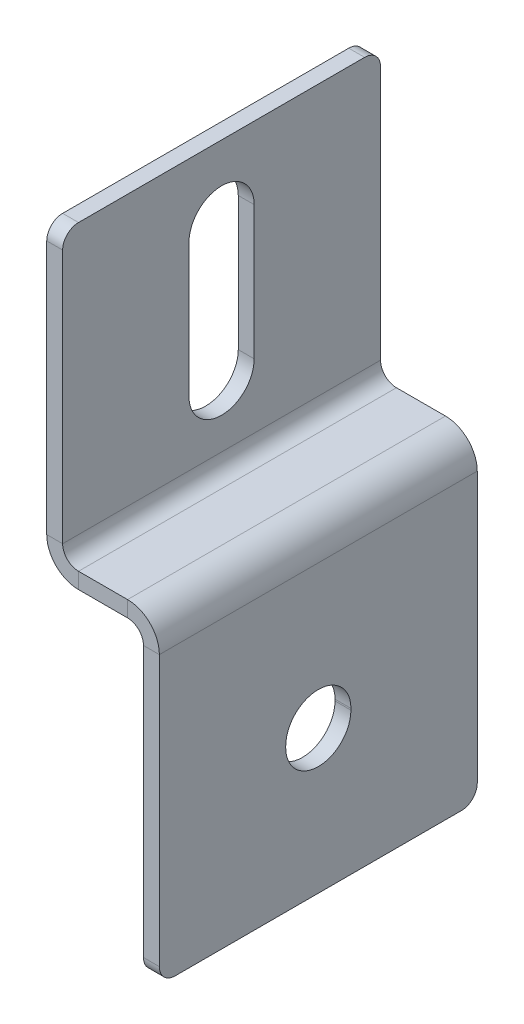
ISO-10303-21;
HEADER;
FILE_DESCRIPTION(('STEP AP214'),'2;1');
FILE_NAME('part.step','',(''),(''),'','','');
FILE_SCHEMA(('AUTOMOTIVE_DESIGN { 1 0 10303 214 1 1 1 1 }'));
ENDSEC;
DATA;
#1=APPLICATION_CONTEXT('core data for automotive mechanical design processes');
#2=APPLICATION_PROTOCOL_DEFINITION('international standard','automotive_design',2000,#1);
#3=PRODUCT_CONTEXT('',#1,'mechanical');
#4=PRODUCT('Part','Part','',(#3));
#5=PRODUCT_RELATED_PRODUCT_CATEGORY('part','',(#4));
#6=PRODUCT_DEFINITION_FORMATION('','',#4);
#7=PRODUCT_DEFINITION_CONTEXT('part definition',#1,'design');
#8=PRODUCT_DEFINITION('design','',#6,#7);
#9=PRODUCT_DEFINITION_SHAPE('','',#8);
#10=(LENGTH_UNIT() NAMED_UNIT(*) SI_UNIT(.MILLI.,.METRE.));
#11=(NAMED_UNIT(*) PLANE_ANGLE_UNIT() SI_UNIT($,.RADIAN.));
#12=(NAMED_UNIT(*) SI_UNIT($,.STERADIAN.) SOLID_ANGLE_UNIT());
#13=UNCERTAINTY_MEASURE_WITH_UNIT(LENGTH_MEASURE(1.E-05),#10,'distance_accuracy_value','');
#14=(GEOMETRIC_REPRESENTATION_CONTEXT(3) GLOBAL_UNCERTAINTY_ASSIGNED_CONTEXT((#13)) GLOBAL_UNIT_ASSIGNED_CONTEXT((#10,
#11,#12)) REPRESENTATION_CONTEXT('',''));
#15=CARTESIAN_POINT('',(0.,0.,0.));
#16=DIRECTION('',(0.,0.,1.));
#17=DIRECTION('',(1.,0.,0.));
#18=AXIS2_PLACEMENT_3D('',#15,#16,#17);
#19=CARTESIAN_POINT('',(5.72382950558037,-18.8016265865805,4.16300808576047));
#20=DIRECTION('',(0.,0.,-1.));
#21=DIRECTION('',(0.,-1.,0.));
#22=AXIS2_PLACEMENT_3D('',#19,#20,#21);
#23=PLANE('',#22);
#24=DIRECTION('',(1.,0.,0.));
#25=VECTOR('',#24,1.);
#26=CARTESIAN_POINT('',(5.72382950558037,-18.8016265865805,4.16300808576047));
#27=LINE('',#26,#25);
#28=CARTESIAN_POINT('',(3.72382950558036,-18.8016265865805,4.16300808576047));
#29=VERTEX_POINT('',#28);
#30=CARTESIAN_POINT('',(5.72382950558037,-18.8016265865805,4.16300808576047));
#31=VERTEX_POINT('',#30);
#32=EDGE_CURVE('E205',#29,#31,#27,.T.);
#33=ORIENTED_EDGE('',*,*,#32,.F.);
#34=DIRECTION('',(0.,-1.,0.));
#35=VECTOR('',#34,1.);
#36=CARTESIAN_POINT('',(3.72382950558035,3.29837341341954,4.16300808576047));
#37=LINE('',#36,#35);
#38=CARTESIAN_POINT('',(3.72382950558036,-18.6016265865805,4.16300808576047));
#39=VERTEX_POINT('',#38);
#40=EDGE_CURVE('E325',#39,#29,#37,.T.);
#41=ORIENTED_EDGE('',*,*,#40,.F.);
#42=DIRECTION('',(1.,0.,0.));
#43=VECTOR('',#42,1.);
#44=CARTESIAN_POINT('',(5.72382950558037,-18.6016265865805,4.16300808576047));
#45=LINE('',#44,#43);
#46=CARTESIAN_POINT('',(5.72382950558037,-18.6016265865805,4.16300808576047));
#47=VERTEX_POINT('',#46);
#48=EDGE_CURVE('E354',#39,#47,#45,.T.);
#49=ORIENTED_EDGE('',*,*,#48,.T.);
#50=DIRECTION('',(0.,-1.,0.));
#51=VECTOR('',#50,1.);
#52=CARTESIAN_POINT('',(5.72382950558037,-18.8016265865805,4.16300808576047));
#53=LINE('',#52,#51);
#54=EDGE_CURVE('E206',#47,#31,#53,.T.);
#55=ORIENTED_EDGE('',*,*,#54,.T.);
#56=EDGE_LOOP('',(#33,#41,#49,#55));
#57=FACE_BOUND('',#56,.T.);
#58=ADVANCED_FACE('F16',(#57),#23,.T.);
#59=CARTESIAN_POINT('',(5.72382950558037,-18.6016265865805,0.0630080857604264));
#60=DIRECTION('',(-1.,0.,0.));
#61=DIRECTION('',(0.,-1.,0.));
#62=AXIS2_PLACEMENT_3D('',#59,#60,#61);
#63=CYLINDRICAL_SURFACE('',#62,4.10000000000004);
#64=ORIENTED_EDGE('',*,*,#48,.F.);
#65=CARTESIAN_POINT('',(3.72382950558037,-18.6016265865805,0.0630080857604264));
#66=DIRECTION('',(1.,0.,0.));
#67=DIRECTION('',(0.,1.,0.));
#68=AXIS2_PLACEMENT_3D('',#65,#66,#67);
#69=CIRCLE('',#68,4.10000000000004);
#70=CARTESIAN_POINT('',(3.72382950558036,-18.6016265865805,-4.03699191423961));
#71=VERTEX_POINT('',#70);
#72=EDGE_CURVE('E311',#71,#39,#69,.T.);
#73=ORIENTED_EDGE('',*,*,#72,.F.);
#74=DIRECTION('',(1.,0.,0.));
#75=VECTOR('',#74,1.);
#76=CARTESIAN_POINT('',(5.72382950558037,-18.6016265865805,-4.03699191423961));
#77=LINE('',#76,#75);
#78=CARTESIAN_POINT('',(5.72382950558037,-18.6016265865805,-4.03699191423961));
#79=VERTEX_POINT('',#78);
#80=EDGE_CURVE('E190',#71,#79,#77,.T.);
#81=ORIENTED_EDGE('',*,*,#80,.T.);
#82=CARTESIAN_POINT('',(5.72382950558037,-18.6016265865805,0.0630080857604264));
#83=DIRECTION('',(1.,0.,0.));
#84=DIRECTION('',(0.,1.,0.));
#85=AXIS2_PLACEMENT_3D('',#82,#83,#84);
#86=CIRCLE('',#85,4.10000000000004);
#87=EDGE_CURVE('E201',#79,#47,#86,.T.);
#88=ORIENTED_EDGE('',*,*,#87,.T.);
#89=EDGE_LOOP('',(#64,#73,#81,#88));
#90=FACE_BOUND('',#89,.T.);
#91=ADVANCED_FACE('F489',(#90),#63,.F.);
#92=CARTESIAN_POINT('',(5.72382950558037,-18.8016265865805,-4.03699191423961));
#93=DIRECTION('',(0.,0.,1.));
#94=DIRECTION('',(0.,1.,0.));
#95=AXIS2_PLACEMENT_3D('',#92,#93,#94);
#96=PLANE('',#95);
#97=ORIENTED_EDGE('',*,*,#80,.F.);
#98=DIRECTION('',(0.,-1.,0.));
#99=VECTOR('',#98,1.);
#100=CARTESIAN_POINT('',(3.72382950558035,3.29837341341954,-4.03699191423961));
#101=LINE('',#100,#99);
#102=CARTESIAN_POINT('',(3.72382950558036,-18.8016265865805,-4.03699191423961));
#103=VERTEX_POINT('',#102);
#104=EDGE_CURVE('E185',#103,#71,#101,.F.);
#105=ORIENTED_EDGE('',*,*,#104,.F.);
#106=DIRECTION('',(1.,0.,0.));
#107=VECTOR('',#106,1.);
#108=CARTESIAN_POINT('',(5.72382950558036,-18.8016265865805,-4.03699191423961));
#109=LINE('',#108,#107);
#110=CARTESIAN_POINT('',(5.72382950558036,-18.8016265865805,-4.03699191423961));
#111=VERTEX_POINT('',#110);
#112=EDGE_CURVE('E179',#103,#111,#109,.T.);
#113=ORIENTED_EDGE('',*,*,#112,.T.);
#114=DIRECTION('',(0.,1.,0.));
#115=VECTOR('',#114,1.);
#116=CARTESIAN_POINT('',(5.72382950558037,-18.8016265865805,-4.03699191423961));
#117=LINE('',#116,#115);
#118=EDGE_CURVE('E182',#111,#79,#117,.T.);
#119=ORIENTED_EDGE('',*,*,#118,.T.);
#120=EDGE_LOOP('',(#97,#105,#113,#119));
#121=FACE_BOUND('',#120,.T.);
#122=ADVANCED_FACE('F181',(#121),#96,.T.);
#123=CARTESIAN_POINT('',(-6.44617049441965,3.29837341341954,20.0630080857604));
#124=DIRECTION('',(0.,0.,1.));
#125=DIRECTION('',(-1.,0.,0.));
#126=AXIS2_PLACEMENT_3D('',#123,#124,#125);
#127=PLANE('',#126);
#128=DIRECTION('',(0.,1.,0.));
#129=VECTOR('',#128,1.);
#130=CARTESIAN_POINT('',(-4.44617049441965,3.29837341341954,20.0630080857604));
#131=LINE('',#130,#129);
#132=CARTESIAN_POINT('',(-4.44617049441965,1.29837341341954,20.0630080857604));
#133=VERTEX_POINT('',#132);
#134=CARTESIAN_POINT('',(-4.44617049441965,3.29837341341954,20.0630080857604));
#135=VERTEX_POINT('',#134);
#136=EDGE_CURVE('E191',#133,#135,#131,.T.);
#137=ORIENTED_EDGE('',*,*,#136,.F.);
#138=DIRECTION('',(1.,0.,0.));
#139=VECTOR('',#138,1.);
#140=CARTESIAN_POINT('',(-6.44617049441965,1.29837341341954,20.0630080857604));
#141=LINE('',#140,#139);
#142=CARTESIAN_POINT('',(1.72382950558035,1.29837341341954,20.0630080857604));
#143=VERTEX_POINT('',#142);
#144=EDGE_CURVE('E303',#143,#133,#141,.F.);
#145=ORIENTED_EDGE('',*,*,#144,.F.);
#146=DIRECTION('',(0.,1.,0.));
#147=VECTOR('',#146,1.);
#148=CARTESIAN_POINT('',(1.72382950558035,3.29837341341954,20.0630080857604));
#149=LINE('',#148,#147);
#150=CARTESIAN_POINT('',(1.72382950558035,3.29837341341954,20.0630080857604));
#151=VERTEX_POINT('',#150);
#152=EDGE_CURVE('E349',#143,#151,#149,.T.);
#153=ORIENTED_EDGE('',*,*,#152,.T.);
#154=DIRECTION('',(-1.,0.,0.));
#155=VECTOR('',#154,1.);
#156=CARTESIAN_POINT('',(-6.44617049441965,3.29837341341954,20.0630080857604));
#157=LINE('',#156,#155);
#158=EDGE_CURVE('E202',#151,#135,#157,.T.);
#159=ORIENTED_EDGE('',*,*,#158,.T.);
#160=EDGE_LOOP('',(#137,#145,#153,#159));
#161=FACE_BOUND('',#160,.T.);
#162=ADVANCED_FACE('F417',(#161),#127,.T.);
#163=CARTESIAN_POINT('',(1.72382950558035,-0.701626586580458,20.0630080857604));
#164=DIRECTION('',(0.,0.,-1.));
#165=DIRECTION('',(-1.,0.,0.));
#166=AXIS2_PLACEMENT_3D('',#163,#164,#165);
#167=PLANE('',#166);
#168=ORIENTED_EDGE('',*,*,#152,.F.);
#169=CARTESIAN_POINT('',(1.72382950558035,-0.701626586580458,20.0630080857604));
#170=DIRECTION('',(0.,0.,-1.));
#171=DIRECTION('',(-1.,0.,0.));
#172=AXIS2_PLACEMENT_3D('',#169,#170,#171);
#173=CIRCLE('',#172,2.);
#174=CARTESIAN_POINT('',(3.72382950558035,-0.701626586580458,20.0630080857604));
#175=VERTEX_POINT('',#174);
#176=EDGE_CURVE('E304',#143,#175,#173,.T.);
#177=ORIENTED_EDGE('',*,*,#176,.T.);
#178=DIRECTION('',(1.,0.,0.));
#179=VECTOR('',#178,1.);
#180=CARTESIAN_POINT('',(5.72382950558035,-0.701626586580457,20.0630080857604));
#181=LINE('',#180,#179);
#182=CARTESIAN_POINT('',(5.72382950558035,-0.701626586580457,20.0630080857604));
#183=VERTEX_POINT('',#182);
#184=EDGE_CURVE('E346',#175,#183,#181,.T.);
#185=ORIENTED_EDGE('',*,*,#184,.T.);
#186=CARTESIAN_POINT('',(1.72382950558035,-0.701626586580458,20.0630080857604));
#187=DIRECTION('',(0.,0.,1.));
#188=DIRECTION('',(1.,0.,0.));
#189=AXIS2_PLACEMENT_3D('',#186,#187,#188);
#190=CIRCLE('',#189,4.);
#191=EDGE_CURVE('E248',#151,#183,#190,.F.);
#192=ORIENTED_EDGE('',*,*,#191,.F.);
#193=EDGE_LOOP('',(#168,#177,#185,#192));
#194=FACE_BOUND('',#193,.T.);
#195=ADVANCED_FACE('F450',(#194),#167,.F.);
#196=CARTESIAN_POINT('',(5.72382950558035,3.29837341341954,20.0630080857604));
#197=DIRECTION('',(0.,0.,1.));
#198=DIRECTION('',(0.,1.,0.));
#199=AXIS2_PLACEMENT_3D('',#196,#197,#198);
#200=PLANE('',#199);
#201=DIRECTION('',(0.,-1.,0.));
#202=VECTOR('',#201,1.);
#203=CARTESIAN_POINT('',(3.72382950558035,3.29837341341954,20.0630080857604));
#204=LINE('',#203,#202);
#205=CARTESIAN_POINT('',(3.72382950558036,-34.7016265865805,20.0630080857604));
#206=VERTEX_POINT('',#205);
#207=EDGE_CURVE('E310',#206,#175,#204,.F.);
#208=ORIENTED_EDGE('',*,*,#207,.F.);
#209=DIRECTION('',(-1.,0.,0.));
#210=VECTOR('',#209,1.);
#211=CARTESIAN_POINT('',(5.72382950558036,-34.7016265865805,20.0630080857604));
#212=LINE('',#211,#210);
#213=CARTESIAN_POINT('',(5.72382950558036,-34.7016265865805,20.0630080857604));
#214=VERTEX_POINT('',#213);
#215=EDGE_CURVE('E372',#206,#214,#212,.F.);
#216=ORIENTED_EDGE('',*,*,#215,.T.);
#217=DIRECTION('',(0.,1.,0.));
#218=VECTOR('',#217,1.);
#219=CARTESIAN_POINT('',(5.72382950558035,3.29837341341954,20.0630080857604));
#220=LINE('',#219,#218);
#221=EDGE_CURVE('E214',#214,#183,#220,.T.);
#222=ORIENTED_EDGE('',*,*,#221,.T.);
#223=ORIENTED_EDGE('',*,*,#184,.F.);
#224=EDGE_LOOP('',(#208,#216,#222,#223));
#225=FACE_BOUND('',#224,.T.);
#226=ADVANCED_FACE('F478',(#225),#200,.T.);
#227=CARTESIAN_POINT('',(5.72382950558036,-36.7016265865805,20.0630080857604));
#228=DIRECTION('',(0.,1.,0.));
#229=DIRECTION('',(0.,0.,-1.));
#230=AXIS2_PLACEMENT_3D('',#227,#228,#229);
#231=PLANE('',#230);
#232=DIRECTION('',(0.,0.,1.));
#233=VECTOR('',#232,1.);
#234=CARTESIAN_POINT('',(3.72382950558036,-36.7016265865805,20.0630080857604));
#235=LINE('',#234,#233);
#236=CARTESIAN_POINT('',(3.72382950558036,-36.7016265865805,18.0630080857604));
#237=VERTEX_POINT('',#236);
#238=CARTESIAN_POINT('',(3.72382950558036,-36.7016265865805,-17.9369919142396));
#239=VERTEX_POINT('',#238);
#240=EDGE_CURVE('E281',#237,#239,#235,.F.);
#241=ORIENTED_EDGE('',*,*,#240,.T.);
#242=DIRECTION('',(-1.,0.,0.));
#243=VECTOR('',#242,1.);
#244=CARTESIAN_POINT('',(5.72382950558036,-36.7016265865805,-17.9369919142396));
#245=LINE('',#244,#243);
#246=CARTESIAN_POINT('',(5.72382950558036,-36.7016265865805,-17.9369919142396));
#247=VERTEX_POINT('',#246);
#248=EDGE_CURVE('E359',#239,#247,#245,.F.);
#249=ORIENTED_EDGE('',*,*,#248,.T.);
#250=DIRECTION('',(0.,0.,-1.));
#251=VECTOR('',#250,1.);
#252=CARTESIAN_POINT('',(5.72382950558036,-36.7016265865805,20.0630080857604));
#253=LINE('',#252,#251);
#254=CARTESIAN_POINT('',(5.72382950558036,-36.7016265865805,18.0630080857604));
#255=VERTEX_POINT('',#254);
#256=EDGE_CURVE('E216',#255,#247,#253,.T.);
#257=ORIENTED_EDGE('',*,*,#256,.F.);
#258=DIRECTION('',(1.,0.,0.));
#259=VECTOR('',#258,1.);
#260=CARTESIAN_POINT('',(5.72382950558036,-36.7016265865805,18.0630080857604));
#261=LINE('',#260,#259);
#262=EDGE_CURVE('E356',#255,#237,#261,.F.);
#263=ORIENTED_EDGE('',*,*,#262,.T.);
#264=EDGE_LOOP('',(#241,#249,#257,#263));
#265=FACE_BOUND('',#264,.T.);
#266=ADVANCED_FACE('F470',(#265),#231,.F.);
#267=CARTESIAN_POINT('',(5.72382950558035,3.29837341341954,-19.9369919142396));
#268=DIRECTION('',(0.,0.,1.));
#269=DIRECTION('',(0.,1.,0.));
#270=AXIS2_PLACEMENT_3D('',#267,#268,#269);
#271=PLANE('',#270);
#272=DIRECTION('',(0.,1.,0.));
#273=VECTOR('',#272,1.);
#274=CARTESIAN_POINT('',(5.72382950558035,3.29837341341954,-19.9369919142396));
#275=LINE('',#274,#273);
#276=CARTESIAN_POINT('',(5.72382950558036,-34.7016265865805,-19.9369919142396));
#277=VERTEX_POINT('',#276);
#278=CARTESIAN_POINT('',(5.72382950558035,-0.701626586580457,-19.9369919142396));
#279=VERTEX_POINT('',#278);
#280=EDGE_CURVE('E212',#277,#279,#275,.T.);
#281=ORIENTED_EDGE('',*,*,#280,.F.);
#282=DIRECTION('',(-1.,0.,0.));
#283=VECTOR('',#282,1.);
#284=CARTESIAN_POINT('',(5.72382950558036,-34.7016265865805,-19.9369919142396));
#285=LINE('',#284,#283);
#286=CARTESIAN_POINT('',(3.72382950558036,-34.7016265865805,-19.9369919142396));
#287=VERTEX_POINT('',#286);
#288=EDGE_CURVE('E366',#277,#287,#285,.T.);
#289=ORIENTED_EDGE('',*,*,#288,.T.);
#290=DIRECTION('',(0.,-1.,0.));
#291=VECTOR('',#290,1.);
#292=CARTESIAN_POINT('',(3.72382950558035,3.29837341341954,-19.9369919142396));
#293=LINE('',#292,#291);
#294=CARTESIAN_POINT('',(3.72382950558035,-0.701626586580457,-19.9369919142396));
#295=VERTEX_POINT('',#294);
#296=EDGE_CURVE('E308',#287,#295,#293,.F.);
#297=ORIENTED_EDGE('',*,*,#296,.T.);
#298=DIRECTION('',(1.,0.,0.));
#299=VECTOR('',#298,1.);
#300=CARTESIAN_POINT('',(5.72382950558035,-0.701626586580457,-19.9369919142396));
#301=LINE('',#300,#299);
#302=EDGE_CURVE('E343',#295,#279,#301,.T.);
#303=ORIENTED_EDGE('',*,*,#302,.T.);
#304=EDGE_LOOP('',(#281,#289,#297,#303));
#305=FACE_BOUND('',#304,.T.);
#306=ADVANCED_FACE('F459',(#305),#271,.F.);
#307=CARTESIAN_POINT('',(1.72382950558035,-0.701626586580458,-19.9369919142396));
#308=DIRECTION('',(0.,0.,1.));
#309=DIRECTION('',(1.,0.,0.));
#310=AXIS2_PLACEMENT_3D('',#307,#308,#309);
#311=PLANE('',#310);
#312=ORIENTED_EDGE('',*,*,#302,.F.);
#313=CARTESIAN_POINT('',(1.72382950558035,-0.701626586580458,-19.9369919142396));
#314=DIRECTION('',(0.,0.,-1.));
#315=DIRECTION('',(-1.,0.,0.));
#316=AXIS2_PLACEMENT_3D('',#313,#314,#315);
#317=CIRCLE('',#316,2.);
#318=CARTESIAN_POINT('',(1.72382950558035,1.29837341341954,-19.9369919142396));
#319=VERTEX_POINT('',#318);
#320=EDGE_CURVE('E305',#295,#319,#317,.F.);
#321=ORIENTED_EDGE('',*,*,#320,.T.);
#322=DIRECTION('',(0.,1.,0.));
#323=VECTOR('',#322,1.);
#324=CARTESIAN_POINT('',(1.72382950558035,3.29837341341954,-19.9369919142396));
#325=LINE('',#324,#323);
#326=CARTESIAN_POINT('',(1.72382950558035,3.29837341341954,-19.9369919142396));
#327=VERTEX_POINT('',#326);
#328=EDGE_CURVE('E341',#319,#327,#325,.T.);
#329=ORIENTED_EDGE('',*,*,#328,.T.);
#330=CARTESIAN_POINT('',(1.72382950558035,-0.701626586580458,-19.9369919142396));
#331=DIRECTION('',(0.,0.,-1.));
#332=DIRECTION('',(-1.,0.,0.));
#333=AXIS2_PLACEMENT_3D('',#330,#331,#332);
#334=CIRCLE('',#333,4.);
#335=EDGE_CURVE('E245',#279,#327,#334,.F.);
#336=ORIENTED_EDGE('',*,*,#335,.F.);
#337=EDGE_LOOP('',(#312,#321,#329,#336));
#338=FACE_BOUND('',#337,.T.);
#339=ADVANCED_FACE('F444',(#338),#311,.F.);
#340=CARTESIAN_POINT('',(-6.44617049441965,3.29837341341954,-19.9369919142396));
#341=DIRECTION('',(0.,0.,1.));
#342=DIRECTION('',(-1.,0.,0.));
#343=AXIS2_PLACEMENT_3D('',#340,#341,#342);
#344=PLANE('',#343);
#345=ORIENTED_EDGE('',*,*,#328,.F.);
#346=DIRECTION('',(1.,0.,0.));
#347=VECTOR('',#346,1.);
#348=CARTESIAN_POINT('',(-6.44617049441965,1.29837341341954,-19.9369919142396));
#349=LINE('',#348,#347);
#350=CARTESIAN_POINT('',(-4.44617049441965,1.29837341341954,-19.9369919142396));
#351=VERTEX_POINT('',#350);
#352=EDGE_CURVE('E300',#319,#351,#349,.F.);
#353=ORIENTED_EDGE('',*,*,#352,.T.);
#354=DIRECTION('',(0.,1.,0.));
#355=VECTOR('',#354,1.);
#356=CARTESIAN_POINT('',(-4.44617049441965,3.29837341341954,-19.9369919142396));
#357=LINE('',#356,#355);
#358=CARTESIAN_POINT('',(-4.44617049441965,3.29837341341954,-19.9369919142396));
#359=VERTEX_POINT('',#358);
#360=EDGE_CURVE('E339',#351,#359,#357,.T.);
#361=ORIENTED_EDGE('',*,*,#360,.T.);
#362=DIRECTION('',(-1.,0.,0.));
#363=VECTOR('',#362,1.);
#364=CARTESIAN_POINT('',(-6.44617049441965,3.29837341341954,-19.9369919142396));
#365=LINE('',#364,#363);
#366=EDGE_CURVE('E252',#327,#359,#365,.T.);
#367=ORIENTED_EDGE('',*,*,#366,.F.);
#368=EDGE_LOOP('',(#345,#353,#361,#367));
#369=FACE_BOUND('',#368,.T.);
#370=ADVANCED_FACE('F436',(#369),#344,.F.);
#371=CARTESIAN_POINT('',(-4.44617049441965,5.29837341341954,-19.9369919142396));
#372=DIRECTION('',(0.,0.,-1.));
#373=DIRECTION('',(-1.,0.,0.));
#374=AXIS2_PLACEMENT_3D('',#371,#372,#373);
#375=PLANE('',#374);
#376=ORIENTED_EDGE('',*,*,#360,.F.);
#377=CARTESIAN_POINT('',(-4.44617049441965,5.29837341341954,-19.9369919142396));
#378=DIRECTION('',(0.,0.,1.));
#379=DIRECTION('',(1.,0.,0.));
#380=AXIS2_PLACEMENT_3D('',#377,#378,#379);
#381=CIRCLE('',#380,4.);
#382=CARTESIAN_POINT('',(-8.44617049441965,5.29837341341954,-19.9369919142396));
#383=VERTEX_POINT('',#382);
#384=EDGE_CURVE('E296',#351,#383,#381,.F.);
#385=ORIENTED_EDGE('',*,*,#384,.T.);
#386=DIRECTION('',(1.,0.,0.));
#387=VECTOR('',#386,1.);
#388=CARTESIAN_POINT('',(-6.44617049441965,5.29837341341954,-19.9369919142396));
#389=LINE('',#388,#387);
#390=CARTESIAN_POINT('',(-6.44617049441965,5.29837341341954,-19.9369919142396));
#391=VERTEX_POINT('',#390);
#392=EDGE_CURVE('E337',#383,#391,#389,.T.);
#393=ORIENTED_EDGE('',*,*,#392,.T.);
#394=CARTESIAN_POINT('',(-4.44617049441965,5.29837341341954,-19.9369919142396));
#395=DIRECTION('',(0.,0.,1.));
#396=DIRECTION('',(1.,0.,0.));
#397=AXIS2_PLACEMENT_3D('',#394,#395,#396);
#398=CIRCLE('',#397,2.);
#399=EDGE_CURVE('E259',#359,#391,#398,.F.);
#400=ORIENTED_EDGE('',*,*,#399,.F.);
#401=EDGE_LOOP('',(#376,#385,#393,#400));
#402=FACE_BOUND('',#401,.T.);
#403=ADVANCED_FACE('F429',(#402),#375,.T.);
#404=CARTESIAN_POINT('',(-6.44617049441965,39.2983734134195,-19.9369919142396));
#405=DIRECTION('',(0.,0.,1.));
#406=DIRECTION('',(0.,1.,0.));
#407=AXIS2_PLACEMENT_3D('',#404,#405,#406);
#408=PLANE('',#407);
#409=DIRECTION('',(0.,-1.,0.));
#410=VECTOR('',#409,1.);
#411=CARTESIAN_POINT('',(-8.44617049441965,39.2983734134195,-19.9369919142396));
#412=LINE('',#411,#410);
#413=CARTESIAN_POINT('',(-8.44617049441965,37.2983734134195,-19.9369919142396));
#414=VERTEX_POINT('',#413);
#415=EDGE_CURVE('E285',#383,#414,#412,.F.);
#416=ORIENTED_EDGE('',*,*,#415,.T.);
#417=DIRECTION('',(1.,0.,0.));
#418=VECTOR('',#417,1.);
#419=CARTESIAN_POINT('',(-6.44617049441965,37.2983734134195,-19.9369919142396));
#420=LINE('',#419,#418);
#421=CARTESIAN_POINT('',(-6.44617049441965,37.2983734134195,-19.9369919142396));
#422=VERTEX_POINT('',#421);
#423=EDGE_CURVE('E375',#414,#422,#420,.T.);
#424=ORIENTED_EDGE('',*,*,#423,.T.);
#425=DIRECTION('',(0.,1.,0.));
#426=VECTOR('',#425,1.);
#427=CARTESIAN_POINT('',(-6.44617049441965,39.2983734134195,-19.9369919142396));
#428=LINE('',#427,#426);
#429=EDGE_CURVE('E231',#391,#422,#428,.T.);
#430=ORIENTED_EDGE('',*,*,#429,.F.);
#431=ORIENTED_EDGE('',*,*,#392,.F.);
#432=EDGE_LOOP('',(#416,#424,#430,#431));
#433=FACE_BOUND('',#432,.T.);
#434=ADVANCED_FACE('F395',(#433),#408,.F.);
#435=CARTESIAN_POINT('',(-6.44617049441965,39.2983734134195,20.0630080857604));
#436=DIRECTION('',(0.,1.,0.));
#437=DIRECTION('',(0.,0.,-1.));
#438=AXIS2_PLACEMENT_3D('',#435,#436,#437);
#439=PLANE('',#438);
#440=DIRECTION('',(0.,0.,-1.));
#441=VECTOR('',#440,1.);
#442=CARTESIAN_POINT('',(-6.44617049441965,39.2983734134195,20.0630080857604));
#443=LINE('',#442,#441);
#444=CARTESIAN_POINT('',(-6.44617049441965,39.2983734134195,18.0630080857604));
#445=VERTEX_POINT('',#444);
#446=CARTESIAN_POINT('',(-6.44617049441965,39.2983734134195,-17.9369919142396));
#447=VERTEX_POINT('',#446);
#448=EDGE_CURVE('E234',#445,#447,#443,.T.);
#449=ORIENTED_EDGE('',*,*,#448,.T.);
#450=DIRECTION('',(-1.,0.,0.));
#451=VECTOR('',#450,1.);
#452=CARTESIAN_POINT('',(-6.44617049441965,39.2983734134195,-17.9369919142396));
#453=LINE('',#452,#451);
#454=CARTESIAN_POINT('',(-8.44617049441965,39.2983734134195,-17.9369919142396));
#455=VERTEX_POINT('',#454);
#456=EDGE_CURVE('E37',#447,#455,#453,.T.);
#457=ORIENTED_EDGE('',*,*,#456,.T.);
#458=DIRECTION('',(0.,0.,1.));
#459=VECTOR('',#458,1.);
#460=CARTESIAN_POINT('',(-8.44617049441965,39.2983734134195,20.0630080857604));
#461=LINE('',#460,#459);
#462=CARTESIAN_POINT('',(-8.44617049441965,39.2983734134195,18.0630080857604));
#463=VERTEX_POINT('',#462);
#464=EDGE_CURVE('E292',#463,#455,#461,.F.);
#465=ORIENTED_EDGE('',*,*,#464,.F.);
#466=DIRECTION('',(1.,0.,0.));
#467=VECTOR('',#466,1.);
#468=CARTESIAN_POINT('',(-6.44617049441965,39.2983734134195,18.0630080857604));
#469=LINE('',#468,#467);
#470=EDGE_CURVE('E382',#463,#445,#469,.T.);
#471=ORIENTED_EDGE('',*,*,#470,.T.);
#472=EDGE_LOOP('',(#449,#457,#465,#471));
#473=FACE_BOUND('',#472,.T.);
#474=ADVANCED_FACE('F401',(#473),#439,.T.);
#475=CARTESIAN_POINT('',(-6.44617049441965,39.2983734134195,20.0630080857604));
#476=DIRECTION('',(0.,0.,1.));
#477=DIRECTION('',(0.,1.,0.));
#478=AXIS2_PLACEMENT_3D('',#475,#476,#477);
#479=PLANE('',#478);
#480=DIRECTION('',(0.,1.,0.));
#481=VECTOR('',#480,1.);
#482=CARTESIAN_POINT('',(-6.44617049441965,39.2983734134195,20.0630080857604));
#483=LINE('',#482,#481);
#484=CARTESIAN_POINT('',(-6.44617049441965,5.29837341341954,20.0630080857604));
#485=VERTEX_POINT('',#484);
#486=CARTESIAN_POINT('',(-6.44617049441965,37.2983734134195,20.0630080857604));
#487=VERTEX_POINT('',#486);
#488=EDGE_CURVE('E236',#485,#487,#483,.T.);
#489=ORIENTED_EDGE('',*,*,#488,.T.);
#490=DIRECTION('',(1.,0.,0.));
#491=VECTOR('',#490,1.);
#492=CARTESIAN_POINT('',(-6.44617049441965,37.2983734134195,20.0630080857604));
#493=LINE('',#492,#491);
#494=CARTESIAN_POINT('',(-8.44617049441965,37.2983734134195,20.0630080857604));
#495=VERTEX_POINT('',#494);
#496=EDGE_CURVE('E10',#487,#495,#493,.F.);
#497=ORIENTED_EDGE('',*,*,#496,.T.);
#498=DIRECTION('',(0.,-1.,0.));
#499=VECTOR('',#498,1.);
#500=CARTESIAN_POINT('',(-8.44617049441965,39.2983734134195,20.0630080857604));
#501=LINE('',#500,#499);
#502=CARTESIAN_POINT('',(-8.44617049441965,5.29837341341954,20.0630080857604));
#503=VERTEX_POINT('',#502);
#504=EDGE_CURVE('E274',#503,#495,#501,.F.);
#505=ORIENTED_EDGE('',*,*,#504,.F.);
#506=DIRECTION('',(1.,0.,0.));
#507=VECTOR('',#506,1.);
#508=CARTESIAN_POINT('',(-6.44617049441965,5.29837341341954,20.0630080857604));
#509=LINE('',#508,#507);
#510=EDGE_CURVE('E335',#503,#485,#509,.T.);
#511=ORIENTED_EDGE('',*,*,#510,.T.);
#512=EDGE_LOOP('',(#489,#497,#505,#511));
#513=FACE_BOUND('',#512,.T.);
#514=ADVANCED_FACE('F407',(#513),#479,.T.);
#515=CARTESIAN_POINT('',(-6.44617049441965,39.2983734134195,-4.03699191423957));
#516=DIRECTION('',(0.,0.,-1.));
#517=DIRECTION('',(0.,-1.,0.));
#518=AXIS2_PLACEMENT_3D('',#515,#516,#517);
#519=PLANE('',#518);
#520=DIRECTION('',(1.,0.,0.));
#521=VECTOR('',#520,1.);
#522=CARTESIAN_POINT('',(-6.44617049441965,30.1983734134195,-4.03699191423957));
#523=LINE('',#522,#521);
#524=CARTESIAN_POINT('',(-8.44617049441965,30.1983734134195,-4.03699191423957));
#525=VERTEX_POINT('',#524);
#526=CARTESIAN_POINT('',(-6.44617049441965,30.1983734134195,-4.03699191423957));
#527=VERTEX_POINT('',#526);
#528=EDGE_CURVE('E333',#525,#527,#523,.T.);
#529=ORIENTED_EDGE('',*,*,#528,.F.);
#530=DIRECTION('',(0.,-1.,0.));
#531=VECTOR('',#530,1.);
#532=CARTESIAN_POINT('',(-8.44617049441965,39.2983734134195,-4.03699191423957));
#533=LINE('',#532,#531);
#534=CARTESIAN_POINT('',(-8.44617049441965,13.3983734134195,-4.03699191423957));
#535=VERTEX_POINT('',#534);
#536=EDGE_CURVE('E286',#525,#535,#533,.T.);
#537=ORIENTED_EDGE('',*,*,#536,.T.);
#538=DIRECTION('',(1.,0.,0.));
#539=VECTOR('',#538,1.);
#540=CARTESIAN_POINT('',(-6.44617049441965,13.3983734134195,-4.03699191423957));
#541=LINE('',#540,#539);
#542=CARTESIAN_POINT('',(-6.44617049441965,13.3983734134195,-4.03699191423957));
#543=VERTEX_POINT('',#542);
#544=EDGE_CURVE('E331',#535,#543,#541,.T.);
#545=ORIENTED_EDGE('',*,*,#544,.T.);
#546=DIRECTION('',(0.,-1.,0.));
#547=VECTOR('',#546,1.);
#548=CARTESIAN_POINT('',(-6.44617049441965,39.2983734134195,-4.03699191423957));
#549=LINE('',#548,#547);
#550=EDGE_CURVE('E225',#527,#543,#549,.T.);
#551=ORIENTED_EDGE('',*,*,#550,.F.);
#552=EDGE_LOOP('',(#529,#537,#545,#551));
#553=FACE_BOUND('',#552,.T.);
#554=ADVANCED_FACE('F658',(#553),#519,.F.);
#555=CARTESIAN_POINT('',(-6.44617049441965,13.3983734134195,0.0630080857604264));
#556=DIRECTION('',(-1.,0.,0.));
#557=DIRECTION('',(0.,-1.,0.));
#558=AXIS2_PLACEMENT_3D('',#555,#556,#557);
#559=CYLINDRICAL_SURFACE('',#558,4.1);
#560=ORIENTED_EDGE('',*,*,#544,.F.);
#561=CARTESIAN_POINT('',(-8.44617049441965,13.3983734134195,0.0630080857604264));
#562=DIRECTION('',(-1.,0.,0.));
#563=DIRECTION('',(0.,-1.,0.));
#564=AXIS2_PLACEMENT_3D('',#561,#562,#563);
#565=CIRCLE('',#564,4.1);
#566=CARTESIAN_POINT('',(-8.44617049441965,13.3983734134195,4.16300808576043));
#567=VERTEX_POINT('',#566);
#568=EDGE_CURVE('E282',#535,#567,#565,.T.);
#569=ORIENTED_EDGE('',*,*,#568,.T.);
#570=DIRECTION('',(1.,0.,0.));
#571=VECTOR('',#570,1.);
#572=CARTESIAN_POINT('',(-6.44617049441965,13.3983734134195,4.16300808576043));
#573=LINE('',#572,#571);
#574=CARTESIAN_POINT('',(-6.44617049441965,13.3983734134195,4.16300808576043));
#575=VERTEX_POINT('',#574);
#576=EDGE_CURVE('E329',#567,#575,#573,.T.);
#577=ORIENTED_EDGE('',*,*,#576,.T.);
#578=CARTESIAN_POINT('',(-6.44617049441965,13.3983734134195,0.0630080857604264));
#579=DIRECTION('',(-1.,0.,0.));
#580=DIRECTION('',(0.,-1.,0.));
#581=AXIS2_PLACEMENT_3D('',#578,#579,#580);
#582=CIRCLE('',#581,4.1);
#583=EDGE_CURVE('E228',#543,#575,#582,.T.);
#584=ORIENTED_EDGE('',*,*,#583,.F.);
#585=EDGE_LOOP('',(#560,#569,#577,#584));
#586=FACE_BOUND('',#585,.T.);
#587=ADVANCED_FACE('F648',(#586),#559,.F.);
#588=CARTESIAN_POINT('',(-6.44617049441965,39.2983734134195,4.16300808576043));
#589=DIRECTION('',(0.,0.,1.));
#590=DIRECTION('',(0.,1.,0.));
#591=AXIS2_PLACEMENT_3D('',#588,#589,#590);
#592=PLANE('',#591);
#593=ORIENTED_EDGE('',*,*,#576,.F.);
#594=DIRECTION('',(0.,-1.,0.));
#595=VECTOR('',#594,1.);
#596=CARTESIAN_POINT('',(-8.44617049441965,39.2983734134195,4.16300808576043));
#597=LINE('',#596,#595);
#598=CARTESIAN_POINT('',(-8.44617049441965,30.1983734134195,4.16300808576043));
#599=VERTEX_POINT('',#598);
#600=EDGE_CURVE('E277',#567,#599,#597,.F.);
#601=ORIENTED_EDGE('',*,*,#600,.T.);
#602=DIRECTION('',(1.,0.,0.));
#603=VECTOR('',#602,1.);
#604=CARTESIAN_POINT('',(-6.44617049441965,30.1983734134195,4.16300808576043));
#605=LINE('',#604,#603);
#606=CARTESIAN_POINT('',(-6.44617049441965,30.1983734134195,4.16300808576043));
#607=VERTEX_POINT('',#606);
#608=EDGE_CURVE('E258',#599,#607,#605,.T.);
#609=ORIENTED_EDGE('',*,*,#608,.T.);
#610=DIRECTION('',(0.,1.,0.));
#611=VECTOR('',#610,1.);
#612=CARTESIAN_POINT('',(-6.44617049441965,39.2983734134195,4.16300808576043));
#613=LINE('',#612,#611);
#614=EDGE_CURVE('E219',#575,#607,#613,.T.);
#615=ORIENTED_EDGE('',*,*,#614,.F.);
#616=EDGE_LOOP('',(#593,#601,#609,#615));
#617=FACE_BOUND('',#616,.T.);
#618=ADVANCED_FACE('F502',(#617),#592,.F.);
#619=CARTESIAN_POINT('',(5.72382950558037,-18.8016265865805,0.0630080857604264));
#620=DIRECTION('',(-1.,0.,0.));
#621=DIRECTION('',(0.,-1.,0.));
#622=AXIS2_PLACEMENT_3D('',#619,#620,#621);
#623=CYLINDRICAL_SURFACE('',#622,4.10000000000004);
#624=CARTESIAN_POINT('',(3.72382950558037,-18.8016265865805,0.0630080857604264));
#625=DIRECTION('',(1.,0.,0.));
#626=DIRECTION('',(0.,1.,0.));
#627=AXIS2_PLACEMENT_3D('',#624,#625,#626);
#628=CIRCLE('',#627,4.10000000000004);
#629=EDGE_CURVE('E322',#29,#103,#628,.T.);
#630=ORIENTED_EDGE('',*,*,#629,.F.);
#631=ORIENTED_EDGE('',*,*,#32,.T.);
#632=CARTESIAN_POINT('',(5.72382950558037,-18.8016265865805,0.0630080857604264));
#633=DIRECTION('',(1.,0.,0.));
#634=DIRECTION('',(0.,1.,0.));
#635=AXIS2_PLACEMENT_3D('',#632,#633,#634);
#636=CIRCLE('',#635,4.10000000000004);
#637=EDGE_CURVE('E198',#31,#111,#636,.T.);
#638=ORIENTED_EDGE('',*,*,#637,.T.);
#639=ORIENTED_EDGE('',*,*,#112,.F.);
#640=EDGE_LOOP('',(#630,#631,#638,#639));
#641=FACE_BOUND('',#640,.T.);
#642=ADVANCED_FACE('F204',(#641),#623,.F.);
#643=CARTESIAN_POINT('',(-6.44617049441965,30.1983734134195,0.0630080857604298));
#644=DIRECTION('',(-1.,0.,0.));
#645=DIRECTION('',(0.,-1.,0.));
#646=AXIS2_PLACEMENT_3D('',#643,#644,#645);
#647=CYLINDRICAL_SURFACE('',#646,4.1);
#648=CARTESIAN_POINT('',(-8.44617049441965,30.1983734134195,0.0630080857604298));
#649=DIRECTION('',(-1.,0.,0.));
#650=DIRECTION('',(0.,-1.,0.));
#651=AXIS2_PLACEMENT_3D('',#648,#649,#650);
#652=CIRCLE('',#651,4.1);
#653=EDGE_CURVE('E280',#599,#525,#652,.T.);
#654=ORIENTED_EDGE('',*,*,#653,.T.);
#655=ORIENTED_EDGE('',*,*,#528,.T.);
#656=CARTESIAN_POINT('',(-6.44617049441965,30.1983734134195,0.0630080857604298));
#657=DIRECTION('',(-1.,0.,0.));
#658=DIRECTION('',(0.,-1.,0.));
#659=AXIS2_PLACEMENT_3D('',#656,#657,#658);
#660=CIRCLE('',#659,4.1);
#661=EDGE_CURVE('E222',#607,#527,#660,.T.);
#662=ORIENTED_EDGE('',*,*,#661,.F.);
#663=ORIENTED_EDGE('',*,*,#608,.F.);
#664=EDGE_LOOP('',(#654,#655,#662,#663));
#665=FACE_BOUND('',#664,.T.);
#666=ADVANCED_FACE('F501',(#665),#647,.F.);
#667=CARTESIAN_POINT('',(-4.44617049441965,5.29837341341954,20.0630080857604));
#668=DIRECTION('',(0.,0.,1.));
#669=DIRECTION('',(1.,0.,0.));
#670=AXIS2_PLACEMENT_3D('',#667,#668,#669);
#671=PLANE('',#670);
#672=CARTESIAN_POINT('',(-4.44617049441965,5.29837341341954,20.0630080857604));
#673=DIRECTION('',(0.,0.,1.));
#674=DIRECTION('',(1.,0.,0.));
#675=AXIS2_PLACEMENT_3D('',#672,#673,#674);
#676=CIRCLE('',#675,4.);
#677=EDGE_CURVE('E299',#503,#133,#676,.T.);
#678=ORIENTED_EDGE('',*,*,#677,.T.);
#679=ORIENTED_EDGE('',*,*,#136,.T.);
#680=CARTESIAN_POINT('',(-4.44617049441965,5.29837341341954,20.0630080857604));
#681=DIRECTION('',(0.,0.,-1.));
#682=DIRECTION('',(-1.,0.,0.));
#683=AXIS2_PLACEMENT_3D('',#680,#681,#682);
#684=CIRCLE('',#683,2.);
#685=EDGE_CURVE('E249',#485,#135,#684,.F.);
#686=ORIENTED_EDGE('',*,*,#685,.F.);
#687=ORIENTED_EDGE('',*,*,#510,.F.);
#688=EDGE_LOOP('',(#678,#679,#686,#687));
#689=FACE_BOUND('',#688,.T.);
#690=ADVANCED_FACE('F410',(#689),#671,.T.);
#691=CARTESIAN_POINT('',(-6.44617049441965,39.2983734134195,20.0630080857604));
#692=DIRECTION('',(-1.,0.,0.));
#693=DIRECTION('',(0.,-1.,0.));
#694=AXIS2_PLACEMENT_3D('',#691,#692,#693);
#695=PLANE('',#694);
#696=ORIENTED_EDGE('',*,*,#614,.T.);
#697=ORIENTED_EDGE('',*,*,#661,.T.);
#698=ORIENTED_EDGE('',*,*,#550,.T.);
#699=ORIENTED_EDGE('',*,*,#583,.T.);
#700=EDGE_LOOP('',(#696,#697,#698,#699));
#701=FACE_BOUND('',#700,.T.);
#702=ORIENTED_EDGE('',*,*,#429,.T.);
#703=CARTESIAN_POINT('',(-6.44617049441965,37.2983734134195,-17.9369919142396));
#704=DIRECTION('',(-1.,0.,0.));
#705=DIRECTION('',(0.,-1.,0.));
#706=AXIS2_PLACEMENT_3D('',#703,#704,#705);
#707=CIRCLE('',#706,2.);
#708=EDGE_CURVE('E380',#422,#447,#707,.F.);
#709=ORIENTED_EDGE('',*,*,#708,.T.);
#710=ORIENTED_EDGE('',*,*,#448,.F.);
#711=CARTESIAN_POINT('',(-6.44617049441965,37.2983734134195,18.0630080857604));
#712=DIRECTION('',(-1.,0.,0.));
#713=DIRECTION('',(0.,-1.,0.));
#714=AXIS2_PLACEMENT_3D('',#711,#712,#713);
#715=CIRCLE('',#714,2.);
#716=EDGE_CURVE('E378',#445,#487,#715,.F.);
#717=ORIENTED_EDGE('',*,*,#716,.T.);
#718=ORIENTED_EDGE('',*,*,#488,.F.);
#719=DIRECTION('',(0.,0.,-1.));
#720=VECTOR('',#719,1.);
#721=CARTESIAN_POINT('',(-6.44617049441965,5.29837341341954,-19.9369919142396));
#722=LINE('',#721,#720);
#723=EDGE_CURVE('E244',#485,#391,#722,.T.);
#724=ORIENTED_EDGE('',*,*,#723,.T.);
#725=EDGE_LOOP('',(#702,#709,#710,#717,#718,#724));
#726=FACE_BOUND('',#725,.T.);
#727=ADVANCED_FACE('F400',(#701,#726),#695,.F.);
#728=CARTESIAN_POINT('',(5.72382950558035,3.29837341341954,20.0630080857604));
#729=DIRECTION('',(-1.,0.,0.));
#730=DIRECTION('',(0.,-1.,0.));
#731=AXIS2_PLACEMENT_3D('',#728,#729,#730);
#732=PLANE('',#731);
#733=ORIENTED_EDGE('',*,*,#118,.F.);
#734=ORIENTED_EDGE('',*,*,#637,.F.);
#735=ORIENTED_EDGE('',*,*,#54,.F.);
#736=ORIENTED_EDGE('',*,*,#87,.F.);
#737=EDGE_LOOP('',(#733,#734,#735,#736));
#738=FACE_BOUND('',#737,.T.);
#739=ORIENTED_EDGE('',*,*,#256,.T.);
#740=CARTESIAN_POINT('',(5.72382950558036,-34.7016265865805,-17.9369919142396));
#741=DIRECTION('',(-1.,0.,0.));
#742=DIRECTION('',(0.,-1.,0.));
#743=AXIS2_PLACEMENT_3D('',#740,#741,#742);
#744=CIRCLE('',#743,2.);
#745=EDGE_CURVE('E364',#247,#277,#744,.F.);
#746=ORIENTED_EDGE('',*,*,#745,.T.);
#747=ORIENTED_EDGE('',*,*,#280,.T.);
#748=DIRECTION('',(0.,0.,-1.));
#749=VECTOR('',#748,1.);
#750=CARTESIAN_POINT('',(5.72382950558035,-0.701626586580457,20.0630080857604));
#751=LINE('',#750,#749);
#752=EDGE_CURVE('E241',#279,#183,#751,.F.);
#753=ORIENTED_EDGE('',*,*,#752,.T.);
#754=ORIENTED_EDGE('',*,*,#221,.F.);
#755=CARTESIAN_POINT('',(5.72382950558036,-34.7016265865805,18.0630080857604));
#756=DIRECTION('',(-1.,0.,0.));
#757=DIRECTION('',(0.,-1.,0.));
#758=AXIS2_PLACEMENT_3D('',#755,#756,#757);
#759=CIRCLE('',#758,2.);
#760=EDGE_CURVE('E362',#214,#255,#759,.F.);
#761=ORIENTED_EDGE('',*,*,#760,.T.);
#762=EDGE_LOOP('',(#739,#746,#747,#753,#754,#761));
#763=FACE_BOUND('',#762,.T.);
#764=ADVANCED_FACE('F195',(#738,#763),#732,.F.);
#765=CARTESIAN_POINT('',(-6.44617049441965,3.29837341341954,20.0630080857604));
#766=DIRECTION('',(0.,-1.,0.));
#767=DIRECTION('',(0.,0.,-1.));
#768=AXIS2_PLACEMENT_3D('',#765,#766,#767);
#769=PLANE('',#768);
#770=ORIENTED_EDGE('',*,*,#366,.T.);
#771=DIRECTION('',(0.,0.,-1.));
#772=VECTOR('',#771,1.);
#773=CARTESIAN_POINT('',(-4.44617049441965,3.29837341341954,20.0630080857604));
#774=LINE('',#773,#772);
#775=EDGE_CURVE('E255',#359,#135,#774,.F.);
#776=ORIENTED_EDGE('',*,*,#775,.T.);
#777=ORIENTED_EDGE('',*,*,#158,.F.);
#778=DIRECTION('',(0.,0.,-1.));
#779=VECTOR('',#778,1.);
#780=CARTESIAN_POINT('',(1.72382950558035,3.29837341341954,20.0630080857604));
#781=LINE('',#780,#779);
#782=EDGE_CURVE('E238',#151,#327,#781,.T.);
#783=ORIENTED_EDGE('',*,*,#782,.T.);
#784=EDGE_LOOP('',(#770,#776,#777,#783));
#785=FACE_BOUND('',#784,.T.);
#786=ADVANCED_FACE('F422',(#785),#769,.F.);
#787=CARTESIAN_POINT('',(1.72382950558035,-0.701626586580458,20.0630080857604));
#788=DIRECTION('',(0.,0.,-1.));
#789=DIRECTION('',(-1.,0.,0.));
#790=AXIS2_PLACEMENT_3D('',#787,#788,#789);
#791=CYLINDRICAL_SURFACE('',#790,4.);
#792=ORIENTED_EDGE('',*,*,#191,.T.);
#793=ORIENTED_EDGE('',*,*,#752,.F.);
#794=ORIENTED_EDGE('',*,*,#335,.T.);
#795=ORIENTED_EDGE('',*,*,#782,.F.);
#796=EDGE_LOOP('',(#792,#793,#794,#795));
#797=FACE_BOUND('',#796,.T.);
#798=ADVANCED_FACE('F454',(#797),#791,.T.);
#799=CARTESIAN_POINT('',(-4.44617049441965,5.29837341341954,20.0630080857604));
#800=DIRECTION('',(0.,0.,1.));
#801=DIRECTION('',(1.,0.,0.));
#802=AXIS2_PLACEMENT_3D('',#799,#800,#801);
#803=CYLINDRICAL_SURFACE('',#802,2.);
#804=ORIENTED_EDGE('',*,*,#685,.T.);
#805=ORIENTED_EDGE('',*,*,#775,.F.);
#806=ORIENTED_EDGE('',*,*,#399,.T.);
#807=ORIENTED_EDGE('',*,*,#723,.F.);
#808=EDGE_LOOP('',(#804,#805,#806,#807));
#809=FACE_BOUND('',#808,.T.);
#810=ADVANCED_FACE('F414',(#809),#803,.F.);
#811=CARTESIAN_POINT('',(-8.44617049441965,39.2983734134195,20.0630080857604));
#812=DIRECTION('',(-1.,0.,0.));
#813=DIRECTION('',(0.,-1.,0.));
#814=AXIS2_PLACEMENT_3D('',#811,#812,#813);
#815=PLANE('',#814);
#816=ORIENTED_EDGE('',*,*,#600,.F.);
#817=ORIENTED_EDGE('',*,*,#568,.F.);
#818=ORIENTED_EDGE('',*,*,#536,.F.);
#819=ORIENTED_EDGE('',*,*,#653,.F.);
#820=EDGE_LOOP('',(#816,#817,#818,#819));
#821=FACE_BOUND('',#820,.T.);
#822=ORIENTED_EDGE('',*,*,#464,.T.);
#823=CARTESIAN_POINT('',(-8.44617049441965,37.2983734134195,-17.9369919142396));
#824=DIRECTION('',(-1.,0.,0.));
#825=DIRECTION('',(0.,-1.,0.));
#826=AXIS2_PLACEMENT_3D('',#823,#824,#825);
#827=CIRCLE('',#826,2.);
#828=EDGE_CURVE('E24',#455,#414,#827,.T.);
#829=ORIENTED_EDGE('',*,*,#828,.T.);
#830=ORIENTED_EDGE('',*,*,#415,.F.);
#831=DIRECTION('',(0.,0.,1.));
#832=VECTOR('',#831,1.);
#833=CARTESIAN_POINT('',(-8.44617049441965,5.29837341341954,20.0630080857604));
#834=LINE('',#833,#832);
#835=EDGE_CURVE('E265',#503,#383,#834,.F.);
#836=ORIENTED_EDGE('',*,*,#835,.F.);
#837=ORIENTED_EDGE('',*,*,#504,.T.);
#838=CARTESIAN_POINT('',(-8.44617049441965,37.2983734134195,18.0630080857604));
#839=DIRECTION('',(-1.,0.,0.));
#840=DIRECTION('',(0.,-1.,0.));
#841=AXIS2_PLACEMENT_3D('',#838,#839,#840);
#842=CIRCLE('',#841,2.);
#843=EDGE_CURVE('E386',#495,#463,#842,.T.);
#844=ORIENTED_EDGE('',*,*,#843,.T.);
#845=EDGE_LOOP('',(#822,#829,#830,#836,#837,#844));
#846=FACE_BOUND('',#845,.T.);
#847=ADVANCED_FACE('F390',(#821,#846),#815,.T.);
#848=CARTESIAN_POINT('',(3.72382950558035,3.29837341341954,20.0630080857604));
#849=DIRECTION('',(-1.,0.,0.));
#850=DIRECTION('',(0.,-1.,0.));
#851=AXIS2_PLACEMENT_3D('',#848,#849,#850);
#852=PLANE('',#851);
#853=ORIENTED_EDGE('',*,*,#104,.T.);
#854=ORIENTED_EDGE('',*,*,#72,.T.);
#855=ORIENTED_EDGE('',*,*,#40,.T.);
#856=ORIENTED_EDGE('',*,*,#629,.T.);
#857=EDGE_LOOP('',(#853,#854,#855,#856));
#858=FACE_BOUND('',#857,.T.);
#859=ORIENTED_EDGE('',*,*,#296,.F.);
#860=CARTESIAN_POINT('',(3.72382950558036,-34.7016265865805,-17.9369919142396));
#861=DIRECTION('',(-1.,0.,0.));
#862=DIRECTION('',(0.,-1.,0.));
#863=AXIS2_PLACEMENT_3D('',#860,#861,#862);
#864=CIRCLE('',#863,2.);
#865=EDGE_CURVE('E370',#287,#239,#864,.T.);
#866=ORIENTED_EDGE('',*,*,#865,.T.);
#867=ORIENTED_EDGE('',*,*,#240,.F.);
#868=CARTESIAN_POINT('',(3.72382950558036,-34.7016265865805,18.0630080857604));
#869=DIRECTION('',(-1.,0.,0.));
#870=DIRECTION('',(0.,-1.,0.));
#871=AXIS2_PLACEMENT_3D('',#868,#869,#870);
#872=CIRCLE('',#871,2.);
#873=EDGE_CURVE('E368',#237,#206,#872,.T.);
#874=ORIENTED_EDGE('',*,*,#873,.T.);
#875=ORIENTED_EDGE('',*,*,#207,.T.);
#876=DIRECTION('',(0.,0.,1.));
#877=VECTOR('',#876,1.);
#878=CARTESIAN_POINT('',(3.72382950558035,-0.701626586580457,20.0630080857604));
#879=LINE('',#878,#877);
#880=EDGE_CURVE('E268',#295,#175,#879,.T.);
#881=ORIENTED_EDGE('',*,*,#880,.F.);
#882=EDGE_LOOP('',(#859,#866,#867,#874,#875,#881));
#883=FACE_BOUND('',#882,.T.);
#884=ADVANCED_FACE('F463',(#858,#883),#852,.T.);
#885=CARTESIAN_POINT('',(-6.44617049441965,1.29837341341954,20.0630080857604));
#886=DIRECTION('',(0.,-1.,0.));
#887=DIRECTION('',(0.,0.,-1.));
#888=AXIS2_PLACEMENT_3D('',#885,#886,#887);
#889=PLANE('',#888);
#890=ORIENTED_EDGE('',*,*,#352,.F.);
#891=DIRECTION('',(0.,0.,-1.));
#892=VECTOR('',#891,1.);
#893=CARTESIAN_POINT('',(1.72382950558035,1.29837341341954,20.0630080857604));
#894=LINE('',#893,#892);
#895=EDGE_CURVE('E271',#143,#319,#894,.T.);
#896=ORIENTED_EDGE('',*,*,#895,.F.);
#897=ORIENTED_EDGE('',*,*,#144,.T.);
#898=DIRECTION('',(0.,0.,-1.));
#899=VECTOR('',#898,1.);
#900=CARTESIAN_POINT('',(-4.44617049441965,1.29837341341954,20.0630080857604));
#901=LINE('',#900,#899);
#902=EDGE_CURVE('E262',#351,#133,#901,.F.);
#903=ORIENTED_EDGE('',*,*,#902,.F.);
#904=EDGE_LOOP('',(#890,#896,#897,#903));
#905=FACE_BOUND('',#904,.T.);
#906=ADVANCED_FACE('F439',(#905),#889,.T.);
#907=CARTESIAN_POINT('',(1.72382950558035,-0.701626586580458,20.0630080857604));
#908=DIRECTION('',(0.,0.,-1.));
#909=DIRECTION('',(-1.,0.,0.));
#910=AXIS2_PLACEMENT_3D('',#907,#908,#909);
#911=CYLINDRICAL_SURFACE('',#910,2.);
#912=ORIENTED_EDGE('',*,*,#176,.F.);
#913=ORIENTED_EDGE('',*,*,#895,.T.);
#914=ORIENTED_EDGE('',*,*,#320,.F.);
#915=ORIENTED_EDGE('',*,*,#880,.T.);
#916=EDGE_LOOP('',(#912,#913,#914,#915));
#917=FACE_BOUND('',#916,.T.);
#918=ADVANCED_FACE('F448',(#917),#911,.F.);
#919=CARTESIAN_POINT('',(-4.44617049441965,5.29837341341954,20.0630080857604));
#920=DIRECTION('',(0.,0.,1.));
#921=DIRECTION('',(1.,0.,0.));
#922=AXIS2_PLACEMENT_3D('',#919,#920,#921);
#923=CYLINDRICAL_SURFACE('',#922,4.);
#924=ORIENTED_EDGE('',*,*,#677,.F.);
#925=ORIENTED_EDGE('',*,*,#835,.T.);
#926=ORIENTED_EDGE('',*,*,#384,.F.);
#927=ORIENTED_EDGE('',*,*,#902,.T.);
#928=EDGE_LOOP('',(#924,#925,#926,#927));
#929=FACE_BOUND('',#928,.T.);
#930=ADVANCED_FACE('F434',(#929),#923,.T.);
#931=CARTESIAN_POINT('',(5.72382950558036,-34.7016265865805,-17.9369919142396));
#932=DIRECTION('',(1.,0.,0.));
#933=DIRECTION('',(0.,1.,0.));
#934=AXIS2_PLACEMENT_3D('',#931,#932,#933);
#935=CYLINDRICAL_SURFACE('',#934,2.);
#936=ORIENTED_EDGE('',*,*,#865,.F.);
#937=ORIENTED_EDGE('',*,*,#288,.F.);
#938=ORIENTED_EDGE('',*,*,#745,.F.);
#939=ORIENTED_EDGE('',*,*,#248,.F.);
#940=EDGE_LOOP('',(#936,#937,#938,#939));
#941=FACE_BOUND('',#940,.T.);
#942=ADVANCED_FACE('F467',(#941),#935,.T.);
#943=CARTESIAN_POINT('',(5.72382950558036,-34.7016265865805,18.0630080857604));
#944=DIRECTION('',(-1.,0.,0.));
#945=DIRECTION('',(0.,-1.,0.));
#946=AXIS2_PLACEMENT_3D('',#943,#944,#945);
#947=CYLINDRICAL_SURFACE('',#946,2.);
#948=ORIENTED_EDGE('',*,*,#873,.F.);
#949=ORIENTED_EDGE('',*,*,#262,.F.);
#950=ORIENTED_EDGE('',*,*,#760,.F.);
#951=ORIENTED_EDGE('',*,*,#215,.F.);
#952=EDGE_LOOP('',(#948,#949,#950,#951));
#953=FACE_BOUND('',#952,.T.);
#954=ADVANCED_FACE('F475',(#953),#947,.T.);
#955=CARTESIAN_POINT('',(-6.44617049441965,37.2983734134195,-17.9369919142396));
#956=DIRECTION('',(-1.,0.,0.));
#957=DIRECTION('',(0.,-1.,0.));
#958=AXIS2_PLACEMENT_3D('',#955,#956,#957);
#959=CYLINDRICAL_SURFACE('',#958,2.);
#960=ORIENTED_EDGE('',*,*,#828,.F.);
#961=ORIENTED_EDGE('',*,*,#456,.F.);
#962=ORIENTED_EDGE('',*,*,#708,.F.);
#963=ORIENTED_EDGE('',*,*,#423,.F.);
#964=EDGE_LOOP('',(#960,#961,#962,#963));
#965=FACE_BOUND('',#964,.T.);
#966=ADVANCED_FACE('F397',(#965),#959,.T.);
#967=CARTESIAN_POINT('',(-6.44617049441965,37.2983734134195,18.0630080857604));
#968=DIRECTION('',(1.,0.,0.));
#969=DIRECTION('',(0.,1.,0.));
#970=AXIS2_PLACEMENT_3D('',#967,#968,#969);
#971=CYLINDRICAL_SURFACE('',#970,2.);
#972=ORIENTED_EDGE('',*,*,#843,.F.);
#973=ORIENTED_EDGE('',*,*,#496,.F.);
#974=ORIENTED_EDGE('',*,*,#716,.F.);
#975=ORIENTED_EDGE('',*,*,#470,.F.);
#976=EDGE_LOOP('',(#972,#973,#974,#975));
#977=FACE_BOUND('',#976,.T.);
#978=ADVANCED_FACE('F18',(#977),#971,.T.);
#979=CLOSED_SHELL('',(#58,#91,#122,#162,#195,#226,#266,#306,#339,#370,#403,#434,#474,#514,#554,
#587,#618,#642,#666,#690,#727,#764,#786,#798,#810,#847,#884,#906,#918,#930,#942,#954,#966,#978));
#980=MANIFOLD_SOLID_BREP('B1',#979);
#981=ADVANCED_BREP_SHAPE_REPRESENTATION('',(#18,#980),#14);
#982=SHAPE_DEFINITION_REPRESENTATION(#9,#981);
ENDSEC;
END-ISO-10303-21;
